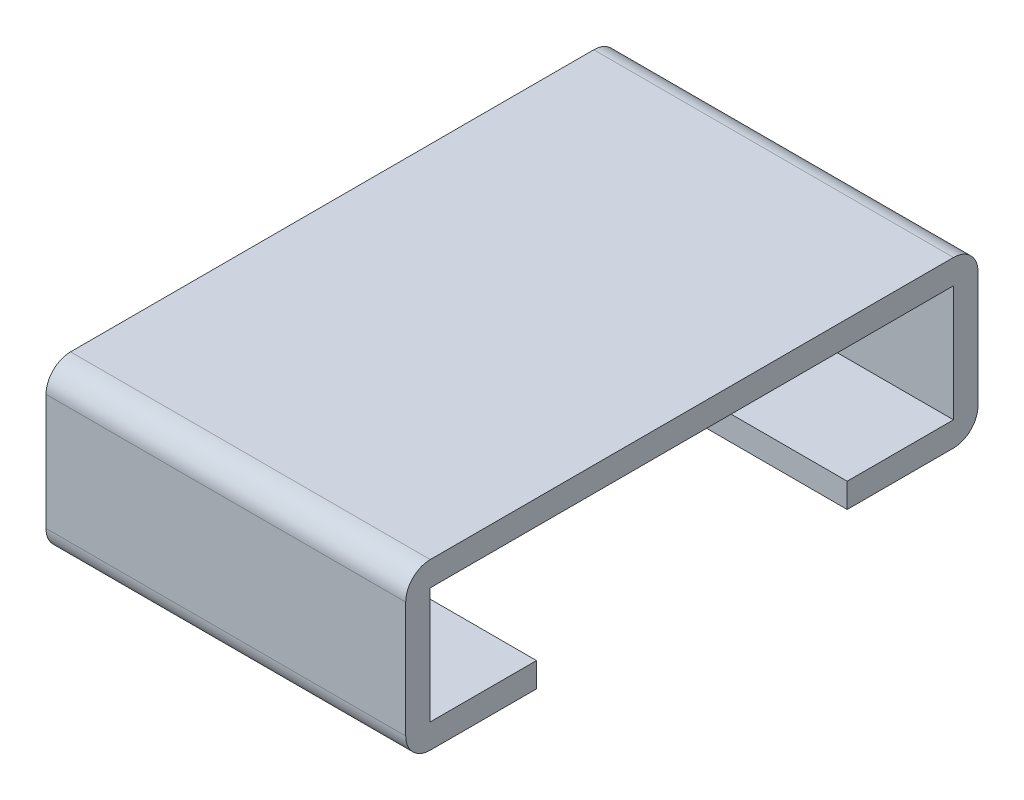
ISO-10303-21;
HEADER;
FILE_DESCRIPTION(('STEP AP214'),'2;1');
FILE_NAME('part.step','',(''),(''),'','','');
FILE_SCHEMA(('AUTOMOTIVE_DESIGN { 1 0 10303 214 1 1 1 1 }'));
ENDSEC;
DATA;
#1=APPLICATION_CONTEXT('core data for automotive mechanical design processes');
#2=APPLICATION_PROTOCOL_DEFINITION('international standard','automotive_design',2000,#1);
#3=PRODUCT_CONTEXT('',#1,'mechanical');
#4=PRODUCT('Part','Part','',(#3));
#5=PRODUCT_RELATED_PRODUCT_CATEGORY('part','',(#4));
#6=PRODUCT_DEFINITION_FORMATION('','',#4);
#7=PRODUCT_DEFINITION_CONTEXT('part definition',#1,'design');
#8=PRODUCT_DEFINITION('design','',#6,#7);
#9=PRODUCT_DEFINITION_SHAPE('','',#8);
#10=(LENGTH_UNIT() NAMED_UNIT(*) SI_UNIT(.MILLI.,.METRE.));
#11=(NAMED_UNIT(*) PLANE_ANGLE_UNIT() SI_UNIT($,.RADIAN.));
#12=(NAMED_UNIT(*) SI_UNIT($,.STERADIAN.) SOLID_ANGLE_UNIT());
#13=UNCERTAINTY_MEASURE_WITH_UNIT(LENGTH_MEASURE(1.E-05),#10,'distance_accuracy_value','');
#14=(GEOMETRIC_REPRESENTATION_CONTEXT(3) GLOBAL_UNCERTAINTY_ASSIGNED_CONTEXT((#13)) GLOBAL_UNIT_ASSIGNED_CONTEXT((#10,
#11,#12)) REPRESENTATION_CONTEXT('',''));
#15=CARTESIAN_POINT('',(0.,0.,0.));
#16=DIRECTION('',(0.,0.,1.));
#17=DIRECTION('',(1.,0.,0.));
#18=AXIS2_PLACEMENT_3D('',#15,#16,#17);
#19=CARTESIAN_POINT('',(0.,0.15,-1.6));
#20=DIRECTION('',(1.,0.,0.));
#21=DIRECTION('',(0.,0.,-1.));
#22=AXIS2_PLACEMENT_3D('',#19,#20,#21);
#23=CYLINDRICAL_SURFACE('',#22,0.15);
#24=DIRECTION('',(1.,0.,0.));
#25=VECTOR('',#24,1.);
#26=CARTESIAN_POINT('',(0.,0.,-1.6));
#27=LINE('',#26,#25);
#28=CARTESIAN_POINT('',(-1.1,0.,-1.6));
#29=VERTEX_POINT('',#28);
#30=CARTESIAN_POINT('',(1.1,0.,-1.6));
#31=VERTEX_POINT('',#30);
#32=EDGE_CURVE('E130',#29,#31,#27,.T.);
#33=ORIENTED_EDGE('',*,*,#32,.F.);
#34=CARTESIAN_POINT('',(-1.1,0.15,-1.6));
#35=DIRECTION('',(1.,0.,0.));
#36=DIRECTION('',(0.,0.,-1.));
#37=AXIS2_PLACEMENT_3D('',#34,#35,#36);
#38=CIRCLE('',#37,0.15);
#39=CARTESIAN_POINT('',(-1.1,0.15,-1.75));
#40=VERTEX_POINT('',#39);
#41=EDGE_CURVE('E135',#29,#40,#38,.T.);
#42=ORIENTED_EDGE('',*,*,#41,.T.);
#43=DIRECTION('',(-1.,0.,0.));
#44=VECTOR('',#43,1.);
#45=CARTESIAN_POINT('',(0.,0.15,-1.75));
#46=LINE('',#45,#44);
#47=CARTESIAN_POINT('',(1.1,0.15,-1.75));
#48=VERTEX_POINT('',#47);
#49=EDGE_CURVE('E133',#48,#40,#46,.T.);
#50=ORIENTED_EDGE('',*,*,#49,.F.);
#51=CARTESIAN_POINT('',(1.1,0.15,-1.6));
#52=DIRECTION('',(1.,0.,0.));
#53=DIRECTION('',(0.,0.,-1.));
#54=AXIS2_PLACEMENT_3D('',#51,#52,#53);
#55=CIRCLE('',#54,0.15);
#56=EDGE_CURVE('E20',#48,#31,#55,.F.);
#57=ORIENTED_EDGE('',*,*,#56,.T.);
#58=EDGE_LOOP('',(#33,#42,#50,#57));
#59=FACE_BOUND('',#58,.T.);
#60=ADVANCED_FACE('F17',(#59),#23,.T.);
#61=CARTESIAN_POINT('',(0.,0.15,1.6));
#62=DIRECTION('',(-1.,0.,0.));
#63=DIRECTION('',(0.,0.,1.));
#64=AXIS2_PLACEMENT_3D('',#61,#62,#63);
#65=CYLINDRICAL_SURFACE('',#64,0.15);
#66=DIRECTION('',(1.,0.,0.));
#67=VECTOR('',#66,1.);
#68=CARTESIAN_POINT('',(0.,0.,1.6));
#69=LINE('',#68,#67);
#70=CARTESIAN_POINT('',(1.1,0.,1.6));
#71=VERTEX_POINT('',#70);
#72=CARTESIAN_POINT('',(-1.1,0.,1.6));
#73=VERTEX_POINT('',#72);
#74=EDGE_CURVE('E202',#71,#73,#69,.F.);
#75=ORIENTED_EDGE('',*,*,#74,.F.);
#76=CARTESIAN_POINT('',(1.1,0.15,1.6));
#77=DIRECTION('',(-1.,0.,0.));
#78=DIRECTION('',(0.,0.,1.));
#79=AXIS2_PLACEMENT_3D('',#76,#77,#78);
#80=CIRCLE('',#79,0.15);
#81=CARTESIAN_POINT('',(1.1,0.15,1.75));
#82=VERTEX_POINT('',#81);
#83=EDGE_CURVE('E148',#71,#82,#80,.T.);
#84=ORIENTED_EDGE('',*,*,#83,.T.);
#85=DIRECTION('',(1.,0.,0.));
#86=VECTOR('',#85,1.);
#87=CARTESIAN_POINT('',(0.,0.15,1.75));
#88=LINE('',#87,#86);
#89=CARTESIAN_POINT('',(-1.1,0.15,1.75));
#90=VERTEX_POINT('',#89);
#91=EDGE_CURVE('E227',#90,#82,#88,.T.);
#92=ORIENTED_EDGE('',*,*,#91,.F.);
#93=CARTESIAN_POINT('',(-1.1,0.15,1.6));
#94=DIRECTION('',(-1.,0.,0.));
#95=DIRECTION('',(0.,0.,1.));
#96=AXIS2_PLACEMENT_3D('',#93,#94,#95);
#97=CIRCLE('',#96,0.15);
#98=EDGE_CURVE('E150',#90,#73,#97,.F.);
#99=ORIENTED_EDGE('',*,*,#98,.T.);
#100=EDGE_LOOP('',(#75,#84,#92,#99));
#101=FACE_BOUND('',#100,.T.);
#102=ADVANCED_FACE('F287',(#101),#65,.T.);
#103=CARTESIAN_POINT('',(0.,0.,-0.95));
#104=DIRECTION('',(0.,-1.,0.));
#105=DIRECTION('',(0.,0.,-1.));
#106=AXIS2_PLACEMENT_3D('',#103,#104,#105);
#107=PLANE('',#106);
#108=DIRECTION('',(1.,0.,0.));
#109=VECTOR('',#108,1.);
#110=CARTESIAN_POINT('',(0.,0.,-0.95));
#111=LINE('',#110,#109);
#112=CARTESIAN_POINT('',(-1.1,0.,-0.95));
#113=VERTEX_POINT('',#112);
#114=CARTESIAN_POINT('',(1.1,0.,-0.95));
#115=VERTEX_POINT('',#114);
#116=EDGE_CURVE('E159',#113,#115,#111,.T.);
#117=ORIENTED_EDGE('',*,*,#116,.F.);
#118=DIRECTION('',(0.,0.,-1.));
#119=VECTOR('',#118,1.);
#120=CARTESIAN_POINT('',(-1.1,0.,-0.95));
#121=LINE('',#120,#119);
#122=EDGE_CURVE('E145',#113,#29,#121,.T.);
#123=ORIENTED_EDGE('',*,*,#122,.T.);
#124=ORIENTED_EDGE('',*,*,#32,.T.);
#125=DIRECTION('',(0.,0.,-1.));
#126=VECTOR('',#125,1.);
#127=CARTESIAN_POINT('',(1.1,0.,-0.95));
#128=LINE('',#127,#126);
#129=EDGE_CURVE('E137',#31,#115,#128,.F.);
#130=ORIENTED_EDGE('',*,*,#129,.T.);
#131=EDGE_LOOP('',(#117,#123,#124,#130));
#132=FACE_BOUND('',#131,.T.);
#133=ADVANCED_FACE('F147',(#132),#107,.T.);
#134=CARTESIAN_POINT('',(0.,0.15,-1.75));
#135=DIRECTION('',(0.,0.,-1.));
#136=DIRECTION('',(-1.,0.,0.));
#137=AXIS2_PLACEMENT_3D('',#134,#135,#136);
#138=PLANE('',#137);
#139=ORIENTED_EDGE('',*,*,#49,.T.);
#140=DIRECTION('',(0.,1.,0.));
#141=VECTOR('',#140,1.);
#142=CARTESIAN_POINT('',(-1.1,0.15,-1.75));
#143=LINE('',#142,#141);
#144=CARTESIAN_POINT('',(-1.1,0.86,-1.75));
#145=VERTEX_POINT('',#144);
#146=EDGE_CURVE('E190',#40,#145,#143,.T.);
#147=ORIENTED_EDGE('',*,*,#146,.T.);
#148=DIRECTION('',(1.,0.,0.));
#149=VECTOR('',#148,1.);
#150=CARTESIAN_POINT('',(0.,0.86,-1.75));
#151=LINE('',#150,#149);
#152=CARTESIAN_POINT('',(1.1,0.86,-1.75));
#153=VERTEX_POINT('',#152);
#154=EDGE_CURVE('E184',#153,#145,#151,.F.);
#155=ORIENTED_EDGE('',*,*,#154,.F.);
#156=DIRECTION('',(0.,1.,0.));
#157=VECTOR('',#156,1.);
#158=CARTESIAN_POINT('',(1.1,0.15,-1.75));
#159=LINE('',#158,#157);
#160=EDGE_CURVE('E156',#153,#48,#159,.F.);
#161=ORIENTED_EDGE('',*,*,#160,.T.);
#162=EDGE_LOOP('',(#139,#147,#155,#161));
#163=FACE_BOUND('',#162,.T.);
#164=ADVANCED_FACE('F198',(#163),#138,.T.);
#165=CARTESIAN_POINT('',(0.,0.15,1.75));
#166=DIRECTION('',(0.,0.,1.));
#167=DIRECTION('',(0.,-1.,0.));
#168=AXIS2_PLACEMENT_3D('',#165,#166,#167);
#169=PLANE('',#168);
#170=ORIENTED_EDGE('',*,*,#91,.T.);
#171=DIRECTION('',(0.,-1.,0.));
#172=VECTOR('',#171,1.);
#173=CARTESIAN_POINT('',(1.1,0.15,1.75));
#174=LINE('',#173,#172);
#175=CARTESIAN_POINT('',(1.1,0.86,1.75));
#176=VERTEX_POINT('',#175);
#177=EDGE_CURVE('E206',#82,#176,#174,.F.);
#178=ORIENTED_EDGE('',*,*,#177,.T.);
#179=DIRECTION('',(-1.,0.,0.));
#180=VECTOR('',#179,1.);
#181=CARTESIAN_POINT('',(0.,0.86,1.75));
#182=LINE('',#181,#180);
#183=CARTESIAN_POINT('',(-1.1,0.86,1.75));
#184=VERTEX_POINT('',#183);
#185=EDGE_CURVE('E178',#184,#176,#182,.F.);
#186=ORIENTED_EDGE('',*,*,#185,.F.);
#187=DIRECTION('',(0.,-1.,0.));
#188=VECTOR('',#187,1.);
#189=CARTESIAN_POINT('',(-1.1,0.15,1.75));
#190=LINE('',#189,#188);
#191=EDGE_CURVE('E196',#184,#90,#190,.T.);
#192=ORIENTED_EDGE('',*,*,#191,.T.);
#193=EDGE_LOOP('',(#170,#178,#186,#192));
#194=FACE_BOUND('',#193,.T.);
#195=ADVANCED_FACE('F283',(#194),#169,.T.);
#196=CARTESIAN_POINT('',(0.,0.,0.95));
#197=DIRECTION('',(0.,-1.,0.));
#198=DIRECTION('',(0.,0.,-1.));
#199=AXIS2_PLACEMENT_3D('',#196,#197,#198);
#200=PLANE('',#199);
#201=DIRECTION('',(-1.,0.,0.));
#202=VECTOR('',#201,1.);
#203=CARTESIAN_POINT('',(0.,0.,0.95));
#204=LINE('',#203,#202);
#205=CARTESIAN_POINT('',(1.1,0.,0.95));
#206=VERTEX_POINT('',#205);
#207=CARTESIAN_POINT('',(-1.1,0.,0.95));
#208=VERTEX_POINT('',#207);
#209=EDGE_CURVE('E177',#206,#208,#204,.T.);
#210=ORIENTED_EDGE('',*,*,#209,.F.);
#211=DIRECTION('',(0.,0.,-1.));
#212=VECTOR('',#211,1.);
#213=CARTESIAN_POINT('',(1.1,0.,0.95));
#214=LINE('',#213,#212);
#215=EDGE_CURVE('E161',#206,#71,#214,.F.);
#216=ORIENTED_EDGE('',*,*,#215,.T.);
#217=ORIENTED_EDGE('',*,*,#74,.T.);
#218=DIRECTION('',(0.,0.,-1.));
#219=VECTOR('',#218,1.);
#220=CARTESIAN_POINT('',(-1.1,0.,0.95));
#221=LINE('',#220,#219);
#222=EDGE_CURVE('E205',#73,#208,#221,.T.);
#223=ORIENTED_EDGE('',*,*,#222,.T.);
#224=EDGE_LOOP('',(#210,#216,#217,#223));
#225=FACE_BOUND('',#224,.T.);
#226=ADVANCED_FACE('F290',(#225),#200,.T.);
#227=CARTESIAN_POINT('',(0.,0.075,-0.95));
#228=DIRECTION('',(0.,0.,1.));
#229=DIRECTION('',(1.,0.,0.));
#230=AXIS2_PLACEMENT_3D('',#227,#228,#229);
#231=PLANE('',#230);
#232=DIRECTION('',(1.,0.,0.));
#233=VECTOR('',#232,1.);
#234=CARTESIAN_POINT('',(0.,0.15,-0.95));
#235=LINE('',#234,#233);
#236=CARTESIAN_POINT('',(-1.1,0.15,-0.95));
#237=VERTEX_POINT('',#236);
#238=CARTESIAN_POINT('',(1.1,0.15,-0.95));
#239=VERTEX_POINT('',#238);
#240=EDGE_CURVE('E219',#237,#239,#235,.T.);
#241=ORIENTED_EDGE('',*,*,#240,.F.);
#242=DIRECTION('',(0.,1.,0.));
#243=VECTOR('',#242,1.);
#244=CARTESIAN_POINT('',(-1.1,0.075,-0.95));
#245=LINE('',#244,#243);
#246=EDGE_CURVE('E164',#237,#113,#245,.F.);
#247=ORIENTED_EDGE('',*,*,#246,.T.);
#248=ORIENTED_EDGE('',*,*,#116,.T.);
#249=DIRECTION('',(0.,1.,0.));
#250=VECTOR('',#249,1.);
#251=CARTESIAN_POINT('',(1.1,0.075,-0.95));
#252=LINE('',#251,#250);
#253=EDGE_CURVE('E141',#115,#239,#252,.T.);
#254=ORIENTED_EDGE('',*,*,#253,.T.);
#255=EDGE_LOOP('',(#241,#247,#248,#254));
#256=FACE_BOUND('',#255,.T.);
#257=ADVANCED_FACE('F325',(#256),#231,.T.);
#258=CARTESIAN_POINT('',(0.,0.86,-1.6));
#259=DIRECTION('',(1.,0.,0.));
#260=DIRECTION('',(0.,0.,-1.));
#261=AXIS2_PLACEMENT_3D('',#258,#259,#260);
#262=CYLINDRICAL_SURFACE('',#261,0.15);
#263=ORIENTED_EDGE('',*,*,#154,.T.);
#264=CARTESIAN_POINT('',(-1.1,0.86,-1.6));
#265=DIRECTION('',(1.,0.,0.));
#266=DIRECTION('',(0.,0.,-1.));
#267=AXIS2_PLACEMENT_3D('',#264,#265,#266);
#268=CIRCLE('',#267,0.15);
#269=CARTESIAN_POINT('',(-1.1,1.01,-1.6));
#270=VERTEX_POINT('',#269);
#271=EDGE_CURVE('E182',#145,#270,#268,.T.);
#272=ORIENTED_EDGE('',*,*,#271,.T.);
#273=DIRECTION('',(1.,0.,0.));
#274=VECTOR('',#273,1.);
#275=CARTESIAN_POINT('',(0.,1.01,-1.6));
#276=LINE('',#275,#274);
#277=CARTESIAN_POINT('',(1.1,1.01,-1.6));
#278=VERTEX_POINT('',#277);
#279=EDGE_CURVE('E240',#278,#270,#276,.F.);
#280=ORIENTED_EDGE('',*,*,#279,.F.);
#281=CARTESIAN_POINT('',(1.1,0.86,-1.6));
#282=DIRECTION('',(1.,0.,0.));
#283=DIRECTION('',(0.,0.,-1.));
#284=AXIS2_PLACEMENT_3D('',#281,#282,#283);
#285=CIRCLE('',#284,0.15);
#286=EDGE_CURVE('E167',#278,#153,#285,.F.);
#287=ORIENTED_EDGE('',*,*,#286,.T.);
#288=EDGE_LOOP('',(#263,#272,#280,#287));
#289=FACE_BOUND('',#288,.T.);
#290=ADVANCED_FACE('F237',(#289),#262,.T.);
#291=CARTESIAN_POINT('',(0.,0.86,1.6));
#292=DIRECTION('',(-1.,0.,0.));
#293=DIRECTION('',(0.,0.,1.));
#294=AXIS2_PLACEMENT_3D('',#291,#292,#293);
#295=CYLINDRICAL_SURFACE('',#294,0.15);
#296=ORIENTED_EDGE('',*,*,#185,.T.);
#297=CARTESIAN_POINT('',(1.1,0.86,1.6));
#298=DIRECTION('',(-1.,0.,0.));
#299=DIRECTION('',(0.,0.,1.));
#300=AXIS2_PLACEMENT_3D('',#297,#298,#299);
#301=CIRCLE('',#300,0.15);
#302=CARTESIAN_POINT('',(1.1,1.01,1.6));
#303=VERTEX_POINT('',#302);
#304=EDGE_CURVE('E175',#176,#303,#301,.T.);
#305=ORIENTED_EDGE('',*,*,#304,.T.);
#306=DIRECTION('',(1.,0.,0.));
#307=VECTOR('',#306,1.);
#308=CARTESIAN_POINT('',(0.,1.01,1.6));
#309=LINE('',#308,#307);
#310=CARTESIAN_POINT('',(-1.1,1.01,1.6));
#311=VERTEX_POINT('',#310);
#312=EDGE_CURVE('E274',#311,#303,#309,.T.);
#313=ORIENTED_EDGE('',*,*,#312,.F.);
#314=CARTESIAN_POINT('',(-1.1,0.86,1.6));
#315=DIRECTION('',(-1.,0.,0.));
#316=DIRECTION('',(0.,0.,1.));
#317=AXIS2_PLACEMENT_3D('',#314,#315,#316);
#318=CIRCLE('',#317,0.15);
#319=EDGE_CURVE('E179',#311,#184,#318,.F.);
#320=ORIENTED_EDGE('',*,*,#319,.T.);
#321=EDGE_LOOP('',(#296,#305,#313,#320));
#322=FACE_BOUND('',#321,.T.);
#323=ADVANCED_FACE('F281',(#322),#295,.T.);
#324=CARTESIAN_POINT('',(0.,0.075,0.95));
#325=DIRECTION('',(0.,0.,-1.));
#326=DIRECTION('',(-1.,0.,0.));
#327=AXIS2_PLACEMENT_3D('',#324,#325,#326);
#328=PLANE('',#327);
#329=DIRECTION('',(1.,0.,0.));
#330=VECTOR('',#329,1.);
#331=CARTESIAN_POINT('',(0.,0.15,0.95));
#332=LINE('',#331,#330);
#333=CARTESIAN_POINT('',(1.1,0.15,0.95));
#334=VERTEX_POINT('',#333);
#335=CARTESIAN_POINT('',(-1.1,0.15,0.95));
#336=VERTEX_POINT('',#335);
#337=EDGE_CURVE('E271',#334,#336,#332,.F.);
#338=ORIENTED_EDGE('',*,*,#337,.F.);
#339=DIRECTION('',(0.,1.,0.));
#340=VECTOR('',#339,1.);
#341=CARTESIAN_POINT('',(1.1,0.075,0.95));
#342=LINE('',#341,#340);
#343=EDGE_CURVE('E216',#334,#206,#342,.F.);
#344=ORIENTED_EDGE('',*,*,#343,.T.);
#345=ORIENTED_EDGE('',*,*,#209,.T.);
#346=DIRECTION('',(0.,1.,0.));
#347=VECTOR('',#346,1.);
#348=CARTESIAN_POINT('',(-1.1,0.075,0.95));
#349=LINE('',#348,#347);
#350=EDGE_CURVE('E213',#208,#336,#349,.T.);
#351=ORIENTED_EDGE('',*,*,#350,.T.);
#352=EDGE_LOOP('',(#338,#344,#345,#351));
#353=FACE_BOUND('',#352,.T.);
#354=ADVANCED_FACE('F294',(#353),#328,.T.);
#355=CARTESIAN_POINT('',(0.,0.15,-0.95));
#356=DIRECTION('',(0.,1.,0.));
#357=DIRECTION('',(0.,0.,1.));
#358=AXIS2_PLACEMENT_3D('',#355,#356,#357);
#359=PLANE('',#358);
#360=ORIENTED_EDGE('',*,*,#240,.T.);
#361=DIRECTION('',(0.,0.,1.));
#362=VECTOR('',#361,1.);
#363=CARTESIAN_POINT('',(1.1,0.15,-0.95));
#364=LINE('',#363,#362);
#365=CARTESIAN_POINT('',(1.1,0.15,-1.6));
#366=VERTEX_POINT('',#365);
#367=EDGE_CURVE('E276',#239,#366,#364,.F.);
#368=ORIENTED_EDGE('',*,*,#367,.T.);
#369=DIRECTION('',(1.,0.,0.));
#370=VECTOR('',#369,1.);
#371=CARTESIAN_POINT('',(0.,0.15,-1.6));
#372=LINE('',#371,#370);
#373=CARTESIAN_POINT('',(-1.1,0.15,-1.6));
#374=VERTEX_POINT('',#373);
#375=EDGE_CURVE('E258',#374,#366,#372,.T.);
#376=ORIENTED_EDGE('',*,*,#375,.F.);
#377=DIRECTION('',(0.,0.,1.));
#378=VECTOR('',#377,1.);
#379=CARTESIAN_POINT('',(-1.1,0.15,0.95));
#380=LINE('',#379,#378);
#381=EDGE_CURVE('E264',#237,#374,#380,.F.);
#382=ORIENTED_EDGE('',*,*,#381,.F.);
#383=EDGE_LOOP('',(#360,#368,#376,#382));
#384=FACE_BOUND('',#383,.T.);
#385=ADVANCED_FACE('F323',(#384),#359,.T.);
#386=CARTESIAN_POINT('',(0.,1.01,1.6));
#387=DIRECTION('',(0.,1.,0.));
#388=DIRECTION('',(0.,0.,1.));
#389=AXIS2_PLACEMENT_3D('',#386,#387,#388);
#390=PLANE('',#389);
#391=DIRECTION('',(0.,0.,1.));
#392=VECTOR('',#391,1.);
#393=CARTESIAN_POINT('',(-1.1,1.01,0.95));
#394=LINE('',#393,#392);
#395=EDGE_CURVE('E266',#311,#270,#394,.F.);
#396=ORIENTED_EDGE('',*,*,#395,.F.);
#397=ORIENTED_EDGE('',*,*,#312,.T.);
#398=DIRECTION('',(0.,0.,1.));
#399=VECTOR('',#398,1.);
#400=CARTESIAN_POINT('',(1.1,1.01,0.95));
#401=LINE('',#400,#399);
#402=EDGE_CURVE('E243',#278,#303,#401,.T.);
#403=ORIENTED_EDGE('',*,*,#402,.F.);
#404=ORIENTED_EDGE('',*,*,#279,.T.);
#405=EDGE_LOOP('',(#396,#397,#403,#404));
#406=FACE_BOUND('',#405,.T.);
#407=ADVANCED_FACE('F350',(#406),#390,.T.);
#408=CARTESIAN_POINT('',(0.,0.15,0.95));
#409=DIRECTION('',(0.,1.,0.));
#410=DIRECTION('',(0.,0.,1.));
#411=AXIS2_PLACEMENT_3D('',#408,#409,#410);
#412=PLANE('',#411);
#413=ORIENTED_EDGE('',*,*,#337,.T.);
#414=DIRECTION('',(0.,0.,1.));
#415=VECTOR('',#414,1.);
#416=CARTESIAN_POINT('',(-1.1,0.15,0.95));
#417=LINE('',#416,#415);
#418=CARTESIAN_POINT('',(-1.1,0.15,1.6));
#419=VERTEX_POINT('',#418);
#420=EDGE_CURVE('E268',#419,#336,#417,.F.);
#421=ORIENTED_EDGE('',*,*,#420,.F.);
#422=DIRECTION('',(-1.,0.,0.));
#423=VECTOR('',#422,1.);
#424=CARTESIAN_POINT('',(0.,0.15,1.6));
#425=LINE('',#424,#423);
#426=CARTESIAN_POINT('',(1.1,0.15,1.6));
#427=VERTEX_POINT('',#426);
#428=EDGE_CURVE('E250',#427,#419,#425,.T.);
#429=ORIENTED_EDGE('',*,*,#428,.F.);
#430=DIRECTION('',(0.,0.,1.));
#431=VECTOR('',#430,1.);
#432=CARTESIAN_POINT('',(1.1,0.15,0.95));
#433=LINE('',#432,#431);
#434=EDGE_CURVE('E253',#334,#427,#433,.T.);
#435=ORIENTED_EDGE('',*,*,#434,.F.);
#436=EDGE_LOOP('',(#413,#421,#429,#435));
#437=FACE_BOUND('',#436,.T.);
#438=ADVANCED_FACE('F299',(#437),#412,.T.);
#439=CARTESIAN_POINT('',(-1.1,0.075,0.95));
#440=DIRECTION('',(-1.,0.,0.));
#441=DIRECTION('',(0.,0.,1.));
#442=AXIS2_PLACEMENT_3D('',#439,#440,#441);
#443=PLANE('',#442);
#444=ORIENTED_EDGE('',*,*,#381,.T.);
#445=DIRECTION('',(0.,1.,0.));
#446=VECTOR('',#445,1.);
#447=CARTESIAN_POINT('',(-1.1,0.15,-1.6));
#448=LINE('',#447,#446);
#449=CARTESIAN_POINT('',(-1.1,0.86,-1.6));
#450=VERTEX_POINT('',#449);
#451=EDGE_CURVE('E261',#450,#374,#448,.F.);
#452=ORIENTED_EDGE('',*,*,#451,.F.);
#453=DIRECTION('',(0.,0.,-1.));
#454=VECTOR('',#453,1.);
#455=CARTESIAN_POINT('',(-1.1,0.86,1.6));
#456=LINE('',#455,#454);
#457=CARTESIAN_POINT('',(-1.1,0.86,1.6));
#458=VERTEX_POINT('',#457);
#459=EDGE_CURVE('E313',#458,#450,#456,.T.);
#460=ORIENTED_EDGE('',*,*,#459,.F.);
#461=DIRECTION('',(0.,1.,0.));
#462=VECTOR('',#461,1.);
#463=CARTESIAN_POINT('',(-1.1,0.15,1.6));
#464=LINE('',#463,#462);
#465=EDGE_CURVE('E303',#419,#458,#464,.T.);
#466=ORIENTED_EDGE('',*,*,#465,.F.);
#467=ORIENTED_EDGE('',*,*,#420,.T.);
#468=ORIENTED_EDGE('',*,*,#350,.F.);
#469=ORIENTED_EDGE('',*,*,#222,.F.);
#470=ORIENTED_EDGE('',*,*,#98,.F.);
#471=ORIENTED_EDGE('',*,*,#191,.F.);
#472=ORIENTED_EDGE('',*,*,#319,.F.);
#473=ORIENTED_EDGE('',*,*,#395,.T.);
#474=ORIENTED_EDGE('',*,*,#271,.F.);
#475=ORIENTED_EDGE('',*,*,#146,.F.);
#476=ORIENTED_EDGE('',*,*,#41,.F.);
#477=ORIENTED_EDGE('',*,*,#122,.F.);
#478=ORIENTED_EDGE('',*,*,#246,.F.);
#479=EDGE_LOOP('',(#444,#452,#460,#466,#467,#468,#469,#470,#471,#472,#473,#474,#475,#476,#477,#478));
#480=FACE_BOUND('',#479,.T.);
#481=ADVANCED_FACE('F191',(#480),#443,.T.);
#482=CARTESIAN_POINT('',(0.,0.15,-1.6));
#483=DIRECTION('',(0.,0.,1.));
#484=DIRECTION('',(1.,0.,0.));
#485=AXIS2_PLACEMENT_3D('',#482,#483,#484);
#486=PLANE('',#485);
#487=ORIENTED_EDGE('',*,*,#375,.T.);
#488=DIRECTION('',(0.,1.,0.));
#489=VECTOR('',#488,1.);
#490=CARTESIAN_POINT('',(1.1,0.075,-1.6));
#491=LINE('',#490,#489);
#492=CARTESIAN_POINT('',(1.1,0.86,-1.6));
#493=VERTEX_POINT('',#492);
#494=EDGE_CURVE('E248',#493,#366,#491,.F.);
#495=ORIENTED_EDGE('',*,*,#494,.F.);
#496=DIRECTION('',(1.,0.,0.));
#497=VECTOR('',#496,1.);
#498=CARTESIAN_POINT('',(0.,0.86,-1.6));
#499=LINE('',#498,#497);
#500=EDGE_CURVE('E311',#450,#493,#499,.T.);
#501=ORIENTED_EDGE('',*,*,#500,.F.);
#502=ORIENTED_EDGE('',*,*,#451,.T.);
#503=EDGE_LOOP('',(#487,#495,#501,#502));
#504=FACE_BOUND('',#503,.T.);
#505=ADVANCED_FACE('F320',(#504),#486,.T.);
#506=CARTESIAN_POINT('',(1.1,0.075,0.95));
#507=DIRECTION('',(1.,0.,0.));
#508=DIRECTION('',(0.,1.,0.));
#509=AXIS2_PLACEMENT_3D('',#506,#507,#508);
#510=PLANE('',#509);
#511=ORIENTED_EDGE('',*,*,#402,.T.);
#512=ORIENTED_EDGE('',*,*,#304,.F.);
#513=ORIENTED_EDGE('',*,*,#177,.F.);
#514=ORIENTED_EDGE('',*,*,#83,.F.);
#515=ORIENTED_EDGE('',*,*,#215,.F.);
#516=ORIENTED_EDGE('',*,*,#343,.F.);
#517=ORIENTED_EDGE('',*,*,#434,.T.);
#518=DIRECTION('',(0.,1.,0.));
#519=VECTOR('',#518,1.);
#520=CARTESIAN_POINT('',(1.1,0.15,1.6));
#521=LINE('',#520,#519);
#522=CARTESIAN_POINT('',(1.1,0.86,1.6));
#523=VERTEX_POINT('',#522);
#524=EDGE_CURVE('E35',#523,#427,#521,.F.);
#525=ORIENTED_EDGE('',*,*,#524,.F.);
#526=DIRECTION('',(0.,0.,-1.));
#527=VECTOR('',#526,1.);
#528=CARTESIAN_POINT('',(1.1,0.86,1.6));
#529=LINE('',#528,#527);
#530=EDGE_CURVE('E26',#493,#523,#529,.F.);
#531=ORIENTED_EDGE('',*,*,#530,.F.);
#532=ORIENTED_EDGE('',*,*,#494,.T.);
#533=ORIENTED_EDGE('',*,*,#367,.F.);
#534=ORIENTED_EDGE('',*,*,#253,.F.);
#535=ORIENTED_EDGE('',*,*,#129,.F.);
#536=ORIENTED_EDGE('',*,*,#56,.F.);
#537=ORIENTED_EDGE('',*,*,#160,.F.);
#538=ORIENTED_EDGE('',*,*,#286,.F.);
#539=EDGE_LOOP('',(#511,#512,#513,#514,#515,#516,#517,#525,#531,#532,#533,#534,#535,#536,#537,#538));
#540=FACE_BOUND('',#539,.T.);
#541=ADVANCED_FACE('F139',(#540),#510,.T.);
#542=CARTESIAN_POINT('',(0.,0.15,1.6));
#543=DIRECTION('',(0.,0.,-1.));
#544=DIRECTION('',(-1.,0.,0.));
#545=AXIS2_PLACEMENT_3D('',#542,#543,#544);
#546=PLANE('',#545);
#547=ORIENTED_EDGE('',*,*,#428,.T.);
#548=ORIENTED_EDGE('',*,*,#465,.T.);
#549=DIRECTION('',(1.,0.,0.));
#550=VECTOR('',#549,1.);
#551=CARTESIAN_POINT('',(0.,0.86,1.6));
#552=LINE('',#551,#550);
#553=EDGE_CURVE('E11',#523,#458,#552,.F.);
#554=ORIENTED_EDGE('',*,*,#553,.F.);
#555=ORIENTED_EDGE('',*,*,#524,.T.);
#556=EDGE_LOOP('',(#547,#548,#554,#555));
#557=FACE_BOUND('',#556,.T.);
#558=ADVANCED_FACE('F304',(#557),#546,.T.);
#559=CARTESIAN_POINT('',(0.,0.86,1.6));
#560=DIRECTION('',(0.,-1.,0.));
#561=DIRECTION('',(0.,0.,-1.));
#562=AXIS2_PLACEMENT_3D('',#559,#560,#561);
#563=PLANE('',#562);
#564=ORIENTED_EDGE('',*,*,#530,.T.);
#565=ORIENTED_EDGE('',*,*,#553,.T.);
#566=ORIENTED_EDGE('',*,*,#459,.T.);
#567=ORIENTED_EDGE('',*,*,#500,.T.);
#568=EDGE_LOOP('',(#564,#565,#566,#567));
#569=FACE_BOUND('',#568,.T.);
#570=ADVANCED_FACE('F309',(#569),#563,.T.);
#571=CLOSED_SHELL('',(#60,#102,#133,#164,#195,#226,#257,#290,#323,#354,#385,#407,#438,#481,#505,
#541,#558,#570));
#572=MANIFOLD_SOLID_BREP('B1',#571);
#573=ADVANCED_BREP_SHAPE_REPRESENTATION('',(#18,#572),#14);
#574=SHAPE_DEFINITION_REPRESENTATION(#9,#573);
ENDSEC;
END-ISO-10303-21;
